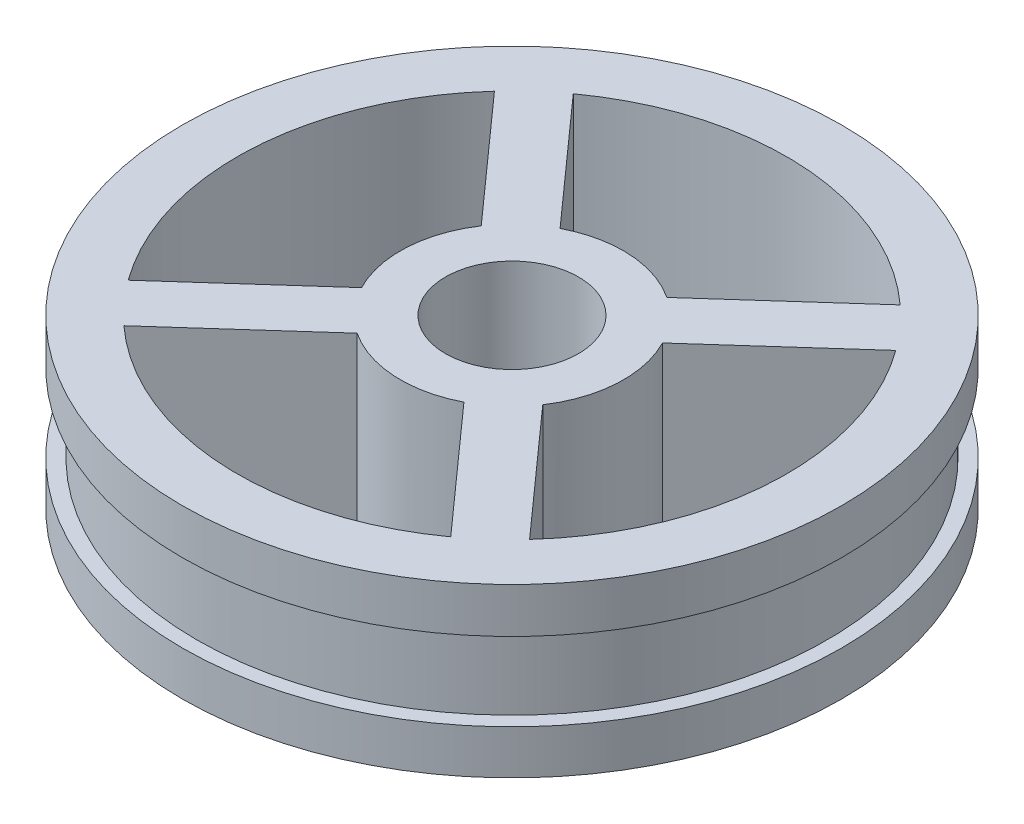
ISO-10303-21;
HEADER;
FILE_DESCRIPTION(('STEP AP214'),'2;1');
FILE_NAME('part.step','',(''),(''),'','','');
FILE_SCHEMA(('AUTOMOTIVE_DESIGN { 1 0 10303 214 1 1 1 1 }'));
ENDSEC;
DATA;
#1=APPLICATION_CONTEXT('core data for automotive mechanical design processes');
#2=APPLICATION_PROTOCOL_DEFINITION('international standard','automotive_design',2000,#1);
#3=PRODUCT_CONTEXT('',#1,'mechanical');
#4=PRODUCT('Part','Part','',(#3));
#5=PRODUCT_RELATED_PRODUCT_CATEGORY('part','',(#4));
#6=PRODUCT_DEFINITION_FORMATION('','',#4);
#7=PRODUCT_DEFINITION_CONTEXT('part definition',#1,'design');
#8=PRODUCT_DEFINITION('design','',#6,#7);
#9=PRODUCT_DEFINITION_SHAPE('','',#8);
#10=(LENGTH_UNIT() NAMED_UNIT(*) SI_UNIT(.MILLI.,.METRE.));
#11=(NAMED_UNIT(*) PLANE_ANGLE_UNIT() SI_UNIT($,.RADIAN.));
#12=(NAMED_UNIT(*) SI_UNIT($,.STERADIAN.) SOLID_ANGLE_UNIT());
#13=UNCERTAINTY_MEASURE_WITH_UNIT(LENGTH_MEASURE(1.E-05),#10,'distance_accuracy_value','');
#14=(GEOMETRIC_REPRESENTATION_CONTEXT(3) GLOBAL_UNCERTAINTY_ASSIGNED_CONTEXT((#13)) GLOBAL_UNIT_ASSIGNED_CONTEXT((#10,
#11,#12)) REPRESENTATION_CONTEXT('',''));
#15=CARTESIAN_POINT('',(0.,0.,0.));
#16=DIRECTION('',(0.,0.,1.));
#17=DIRECTION('',(1.,0.,0.));
#18=AXIS2_PLACEMENT_3D('',#15,#16,#17);
#19=CARTESIAN_POINT('',(0.,20.9873639174843,0.));
#20=DIRECTION('',(0.,-1.,0.));
#21=DIRECTION('',(0.,0.,-1.));
#22=AXIS2_PLACEMENT_3D('',#19,#20,#21);
#23=CYLINDRICAL_SURFACE('',#22,2.032);
#24=CARTESIAN_POINT('',(0.,-3.65,0.));
#25=DIRECTION('',(0.,-1.,0.));
#26=DIRECTION('',(0.,0.,-1.));
#27=AXIS2_PLACEMENT_3D('',#24,#25,#26);
#28=CIRCLE('',#27,2.032);
#29=CARTESIAN_POINT('',(0.,-3.65,-2.032));
#30=VERTEX_POINT('',#29);
#31=EDGE_CURVE('E236',#30,#30,#28,.T.);
#32=ORIENTED_EDGE('',*,*,#31,.T.);
#33=EDGE_LOOP('',(#32));
#34=FACE_BOUND('',#33,.T.);
#35=CARTESIAN_POINT('',(0.,0.,0.));
#36=DIRECTION('',(0.,1.,0.));
#37=DIRECTION('',(0.,0.,1.));
#38=AXIS2_PLACEMENT_3D('',#35,#36,#37);
#39=CIRCLE('',#38,2.032);
#40=CARTESIAN_POINT('',(0.,0.,2.032));
#41=VERTEX_POINT('',#40);
#42=EDGE_CURVE('E62',#41,#41,#39,.F.);
#43=ORIENTED_EDGE('',*,*,#42,.F.);
#44=EDGE_LOOP('',(#43));
#45=FACE_BOUND('',#44,.T.);
#46=ADVANCED_FACE('F58',(#34,#45),#23,.F.);
#47=CARTESIAN_POINT('',(0.,15.24,0.));
#48=DIRECTION('',(0.,-1.,0.));
#49=DIRECTION('',(0.,0.,-1.));
#50=AXIS2_PLACEMENT_3D('',#47,#48,#49);
#51=CYLINDRICAL_SURFACE('',#50,30.);
#52=CARTESIAN_POINT('',(0.,0.,0.));
#53=DIRECTION('',(0.,1.,0.));
#54=DIRECTION('',(0.,0.,1.));
#55=AXIS2_PLACEMENT_3D('',#52,#53,#54);
#56=CIRCLE('',#55,30.);
#57=CARTESIAN_POINT('',(0.,0.,30.));
#58=VERTEX_POINT('',#57);
#59=EDGE_CURVE('E376',#58,#58,#56,.T.);
#60=ORIENTED_EDGE('',*,*,#59,.T.);
#61=EDGE_LOOP('',(#60));
#62=FACE_BOUND('',#61,.T.);
#63=CARTESIAN_POINT('',(0.,4.02260054,0.));
#64=DIRECTION('',(0.,1.,0.));
#65=DIRECTION('',(0.,0.,1.));
#66=AXIS2_PLACEMENT_3D('',#63,#64,#65);
#67=CIRCLE('',#66,30.);
#68=CARTESIAN_POINT('',(0.,4.02260054,30.));
#69=VERTEX_POINT('',#68);
#70=EDGE_CURVE('E272',#69,#69,#67,.T.);
#71=ORIENTED_EDGE('',*,*,#70,.F.);
#72=EDGE_LOOP('',(#71));
#73=FACE_BOUND('',#72,.T.);
#74=ADVANCED_FACE('F403',(#62,#73),#51,.T.);
#75=CARTESIAN_POINT('',(0.,15.24,0.));
#76=DIRECTION('',(0.,-1.,0.));
#77=DIRECTION('',(0.,0.,-1.));
#78=AXIS2_PLACEMENT_3D('',#75,#76,#77);
#79=CYLINDRICAL_SURFACE('',#78,25.);
#80=CARTESIAN_POINT('',(0.,15.24,0.));
#81=DIRECTION('',(0.,1.,0.));
#82=DIRECTION('',(0.,0.,1.));
#83=AXIS2_PLACEMENT_3D('',#80,#81,#82);
#84=CIRCLE('',#83,25.);
#85=CARTESIAN_POINT('',(-18.4586738479268,15.24,-16.8605266755183));
#86=VERTEX_POINT('',#85);
#87=CARTESIAN_POINT('',(-20.2264090300764,15.24,14.6932766171486));
#88=VERTEX_POINT('',#87);
#89=EDGE_CURVE('E368',#86,#88,#84,.T.);
#90=ORIENTED_EDGE('',*,*,#89,.T.);
#91=DIRECTION('',(0.,1.,0.));
#92=VECTOR('',#91,1.);
#93=CARTESIAN_POINT('',(-20.2264090300764,-57.2335696705628,14.6932766171486));
#94=LINE('',#93,#92);
#95=CARTESIAN_POINT('',(-20.2264090300764,0.,14.6932766171486));
#96=VERTEX_POINT('',#95);
#97=EDGE_CURVE('E342',#96,#88,#94,.T.);
#98=ORIENTED_EDGE('',*,*,#97,.F.);
#99=CARTESIAN_POINT('',(0.,0.,0.));
#100=DIRECTION('',(0.,1.,0.));
#101=DIRECTION('',(0.,0.,1.));
#102=AXIS2_PLACEMENT_3D('',#99,#100,#101);
#103=CIRCLE('',#102,25.);
#104=CARTESIAN_POINT('',(-18.4586738479268,0.,-16.8605266755183));
#105=VERTEX_POINT('',#104);
#106=EDGE_CURVE('E373',#105,#96,#103,.T.);
#107=ORIENTED_EDGE('',*,*,#106,.F.);
#108=DIRECTION('',(0.,1.,0.));
#109=VECTOR('',#108,1.);
#110=CARTESIAN_POINT('',(-18.4586738479268,-57.2335696705628,-16.8605266755183));
#111=LINE('',#110,#109);
#112=EDGE_CURVE('E343',#105,#86,#111,.T.);
#113=ORIENTED_EDGE('',*,*,#112,.T.);
#114=EDGE_LOOP('',(#90,#98,#107,#113));
#115=FACE_BOUND('',#114,.T.);
#116=ADVANCED_FACE('F409',(#115),#79,.F.);
#117=DIRECTION('',(0.,1.,0.));
#118=VECTOR('',#117,1.);
#119=CARTESIAN_POINT('',(-16.8386084523767,-57.2335696705628,18.4786705524924));
#120=LINE('',#119,#118);
#121=CARTESIAN_POINT('',(-16.8386084523767,0.,18.4786705524924));
#122=VERTEX_POINT('',#121);
#123=CARTESIAN_POINT('',(-16.8386084523767,15.24,18.4786705524924));
#124=VERTEX_POINT('',#123);
#125=EDGE_CURVE('E360',#122,#124,#120,.T.);
#126=ORIENTED_EDGE('',*,*,#125,.T.);
#127=CARTESIAN_POINT('',(14.6692620108567,15.24,20.2438324448914));
#128=VERTEX_POINT('',#127);
#129=EDGE_CURVE('E365',#124,#128,#84,.T.);
#130=ORIENTED_EDGE('',*,*,#129,.T.);
#131=DIRECTION('',(0.,1.,0.));
#132=VECTOR('',#131,1.);
#133=CARTESIAN_POINT('',(14.6692620108567,-57.2335696705628,20.2438324448914));
#134=LINE('',#133,#132);
#135=CARTESIAN_POINT('',(14.6692620108567,0.,20.2438324448914));
#136=VERTEX_POINT('',#135);
#137=EDGE_CURVE('E358',#136,#128,#134,.T.);
#138=ORIENTED_EDGE('',*,*,#137,.F.);
#139=EDGE_CURVE('E325',#122,#136,#103,.T.);
#140=ORIENTED_EDGE('',*,*,#139,.F.);
#141=EDGE_LOOP('',(#126,#130,#138,#140));
#142=FACE_BOUND('',#141,.T.);
#143=ADVANCED_FACE('F660',(#142),#79,.F.);
#144=CARTESIAN_POINT('',(16.8386084523767,0.,-18.4786705524924));
#145=VERTEX_POINT('',#144);
#146=CARTESIAN_POINT('',(-14.6692620108567,0.,-20.2438324448914));
#147=VERTEX_POINT('',#146);
#148=EDGE_CURVE('E735',#145,#147,#103,.T.);
#149=ORIENTED_EDGE('',*,*,#148,.F.);
#150=DIRECTION('',(0.,1.,0.));
#151=VECTOR('',#150,1.);
#152=CARTESIAN_POINT('',(16.8386084523767,-57.2335696705628,-18.4786705524924));
#153=LINE('',#152,#151);
#154=CARTESIAN_POINT('',(16.8386084523767,15.24,-18.4786705524924));
#155=VERTEX_POINT('',#154);
#156=EDGE_CURVE('E349',#145,#155,#153,.T.);
#157=ORIENTED_EDGE('',*,*,#156,.T.);
#158=CARTESIAN_POINT('',(-14.6692620108567,15.24,-20.2438324448914));
#159=VERTEX_POINT('',#158);
#160=EDGE_CURVE('E697',#155,#159,#84,.T.);
#161=ORIENTED_EDGE('',*,*,#160,.T.);
#162=DIRECTION('',(0.,1.,0.));
#163=VECTOR('',#162,1.);
#164=CARTESIAN_POINT('',(-14.6692620108567,-57.2335696705628,-20.2438324448914));
#165=LINE('',#164,#163);
#166=EDGE_CURVE('E346',#147,#159,#165,.T.);
#167=ORIENTED_EDGE('',*,*,#166,.F.);
#168=EDGE_LOOP('',(#149,#157,#161,#167));
#169=FACE_BOUND('',#168,.T.);
#170=ADVANCED_FACE('F556',(#169),#79,.F.);
#171=CARTESIAN_POINT('',(0.,15.24,0.));
#172=DIRECTION('',(0.,1.,0.));
#173=DIRECTION('',(0.,0.,1.));
#174=AXIS2_PLACEMENT_3D('',#171,#172,#173);
#175=PLANE('',#174);
#176=CARTESIAN_POINT('',(0.,15.24,0.));
#177=DIRECTION('',(0.,1.,0.));
#178=DIRECTION('',(0.,0.,1.));
#179=AXIS2_PLACEMENT_3D('',#176,#177,#178);
#180=CIRCLE('',#179,6.05206443740222);
#181=CARTESIAN_POINT('',(0.,15.24,6.05206443740222));
#182=VERTEX_POINT('',#181);
#183=EDGE_CURVE('E762',#182,#182,#180,.T.);
#184=ORIENTED_EDGE('',*,*,#183,.F.);
#185=EDGE_LOOP('',(#184));
#186=FACE_BOUND('',#185,.T.);
#187=DIRECTION('',(-0.666005072711236,0.,-0.745947212021669));
#188=VECTOR('',#187,1.);
#189=CARTESIAN_POINT('',(1.89470591853503,15.24,-1.69165288468654));
#190=LINE('',#189,#188);
#191=CARTESIAN_POINT('',(18.4586738479268,15.24,16.8605266755183));
#192=VERTEX_POINT('',#191);
#193=CARTESIAN_POINT('',(8.44644936848974,15.24,5.6465115837603));
#194=VERTEX_POINT('',#193);
#195=EDGE_CURVE('E333',#192,#194,#190,.T.);
#196=ORIENTED_EDGE('',*,*,#195,.T.);
#197=CARTESIAN_POINT('',(0.,15.24,0.));
#198=DIRECTION('',(0.,-1.,0.));
#199=DIRECTION('',(0.,0.,-1.));
#200=AXIS2_PLACEMENT_3D('',#197,#198,#199);
#201=CIRCLE('',#200,10.16);
#202=CARTESIAN_POINT('',(9.02428412406039,15.24,-4.66775064117949));
#203=VERTEX_POINT('',#202);
#204=EDGE_CURVE('E281',#203,#194,#201,.T.);
#205=ORIENTED_EDGE('',*,*,#204,.F.);
#206=DIRECTION('',(0.745156286485,0.,-0.66688987749994));
#207=VECTOR('',#206,1.);
#208=CARTESIAN_POINT('',(1.69390028884985,15.24,1.8926969676719));
#209=LINE('',#208,#207);
#210=CARTESIAN_POINT('',(20.2264090300764,15.24,-14.6932766171486));
#211=VERTEX_POINT('',#210);
#212=EDGE_CURVE('E336',#203,#211,#209,.T.);
#213=ORIENTED_EDGE('',*,*,#212,.T.);
#214=EDGE_CURVE('E370',#192,#211,#84,.T.);
#215=ORIENTED_EDGE('',*,*,#214,.F.);
#216=EDGE_LOOP('',(#196,#205,#213,#215));
#217=FACE_BOUND('',#216,.T.);
#218=DIRECTION('',(0.745156286485,0.,-0.66688987749994));
#219=VECTOR('',#218,1.);
#220=CARTESIAN_POINT('',(-1.69390028884985,15.24,-1.8926969676719));
#221=LINE('',#220,#219);
#222=CARTESIAN_POINT('',(5.6364835463607,15.24,-8.45314457652329));
#223=VERTEX_POINT('',#222);
#224=EDGE_CURVE('E338',#223,#155,#221,.T.);
#225=ORIENTED_EDGE('',*,*,#224,.F.);
#226=CARTESIAN_POINT('',(-4.65703753141968,15.24,-9.02981735313337));
#227=VERTEX_POINT('',#226);
#228=EDGE_CURVE('E276',#227,#223,#201,.T.);
#229=ORIENTED_EDGE('',*,*,#228,.F.);
#230=DIRECTION('',(-0.666005072711236,0.,-0.745947212021669));
#231=VECTOR('',#230,1.);
#232=CARTESIAN_POINT('',(1.89470591853503,15.24,-1.69165288468654));
#233=LINE('',#232,#231);
#234=EDGE_CURVE('E340',#227,#159,#233,.T.);
#235=ORIENTED_EDGE('',*,*,#234,.T.);
#236=ORIENTED_EDGE('',*,*,#160,.F.);
#237=EDGE_LOOP('',(#225,#229,#235,#236));
#238=FACE_BOUND('',#237,.T.);
#239=DIRECTION('',(-0.666005072711236,0.,-0.745947212021669));
#240=VECTOR('',#239,1.);
#241=CARTESIAN_POINT('',(-1.89470591853504,15.24,1.69165288468654));
#242=LINE('',#241,#240);
#243=CARTESIAN_POINT('',(-8.44644936848975,15.24,-5.64651158376029));
#244=VERTEX_POINT('',#243);
#245=EDGE_CURVE('E305',#244,#86,#242,.T.);
#246=ORIENTED_EDGE('',*,*,#245,.F.);
#247=CARTESIAN_POINT('',(-9.02428412406039,15.24,4.6677506411795));
#248=VERTEX_POINT('',#247);
#249=EDGE_CURVE('E280',#248,#244,#201,.T.);
#250=ORIENTED_EDGE('',*,*,#249,.F.);
#251=DIRECTION('',(0.745156286485,0.,-0.66688987749994));
#252=VECTOR('',#251,1.);
#253=CARTESIAN_POINT('',(-1.69390028884985,15.24,-1.8926969676719));
#254=LINE('',#253,#252);
#255=EDGE_CURVE('E83',#88,#248,#254,.T.);
#256=ORIENTED_EDGE('',*,*,#255,.F.);
#257=ORIENTED_EDGE('',*,*,#89,.F.);
#258=EDGE_LOOP('',(#246,#250,#256,#257));
#259=FACE_BOUND('',#258,.T.);
#260=CARTESIAN_POINT('',(4.65703753141966,15.24,9.02981735313338));
#261=VERTEX_POINT('',#260);
#262=CARTESIAN_POINT('',(-5.6364835463607,15.24,8.45314457652329));
#263=VERTEX_POINT('',#262);
#264=EDGE_CURVE('E727',#261,#263,#201,.T.);
#265=ORIENTED_EDGE('',*,*,#264,.F.);
#266=DIRECTION('',(-0.666005072711236,0.,-0.745947212021669));
#267=VECTOR('',#266,1.);
#268=CARTESIAN_POINT('',(-1.89470591853504,15.24,1.69165288468654));
#269=LINE('',#268,#267);
#270=EDGE_CURVE('E331',#128,#261,#269,.T.);
#271=ORIENTED_EDGE('',*,*,#270,.F.);
#272=ORIENTED_EDGE('',*,*,#129,.F.);
#273=DIRECTION('',(0.745156286485,0.,-0.66688987749994));
#274=VECTOR('',#273,1.);
#275=CARTESIAN_POINT('',(1.69390028884985,15.24,1.8926969676719));
#276=LINE('',#275,#274);
#277=EDGE_CURVE('E328',#124,#263,#276,.T.);
#278=ORIENTED_EDGE('',*,*,#277,.T.);
#279=EDGE_LOOP('',(#265,#271,#272,#278));
#280=FACE_BOUND('',#279,.T.);
#281=CARTESIAN_POINT('',(0.,15.24,0.));
#282=DIRECTION('',(0.,1.,0.));
#283=DIRECTION('',(0.,0.,1.));
#284=AXIS2_PLACEMENT_3D('',#281,#282,#283);
#285=CIRCLE('',#284,30.);
#286=CARTESIAN_POINT('',(0.,15.24,30.));
#287=VERTEX_POINT('',#286);
#288=EDGE_CURVE('E67',#287,#287,#285,.T.);
#289=ORIENTED_EDGE('',*,*,#288,.T.);
#290=EDGE_LOOP('',(#289));
#291=FACE_BOUND('',#290,.T.);
#292=ADVANCED_FACE('F549',(#186,#217,#238,#259,#280,#291),#175,.T.);
#293=CARTESIAN_POINT('',(0.,0.,0.));
#294=DIRECTION('',(0.,1.,0.));
#295=DIRECTION('',(0.,0.,1.));
#296=AXIS2_PLACEMENT_3D('',#293,#294,#295);
#297=PLANE('',#296);
#298=DIRECTION('',(0.666005072711236,0.,0.745947212021669));
#299=VECTOR('',#298,1.);
#300=CARTESIAN_POINT('',(-1.89470591853504,0.,1.69165288468654));
#301=LINE('',#300,#299);
#302=CARTESIAN_POINT('',(4.65703753141966,0.,9.02981735313338));
#303=VERTEX_POINT('',#302);
#304=EDGE_CURVE('E308',#303,#136,#301,.T.);
#305=ORIENTED_EDGE('',*,*,#304,.F.);
#306=CARTESIAN_POINT('',(0.,0.,0.));
#307=DIRECTION('',(0.,1.,0.));
#308=DIRECTION('',(0.,0.,1.));
#309=AXIS2_PLACEMENT_3D('',#306,#307,#308);
#310=CIRCLE('',#309,10.16);
#311=CARTESIAN_POINT('',(8.44644936848974,0.,5.6465115837603));
#312=VERTEX_POINT('',#311);
#313=EDGE_CURVE('E297',#303,#312,#310,.T.);
#314=ORIENTED_EDGE('',*,*,#313,.T.);
#315=DIRECTION('',(0.666005072711236,0.,0.745947212021669));
#316=VECTOR('',#315,1.);
#317=CARTESIAN_POINT('',(1.89470591853503,0.,-1.69165288468654));
#318=LINE('',#317,#316);
#319=CARTESIAN_POINT('',(18.4586738479268,0.,16.8605266755183));
#320=VERTEX_POINT('',#319);
#321=EDGE_CURVE('E311',#312,#320,#318,.T.);
#322=ORIENTED_EDGE('',*,*,#321,.T.);
#323=CARTESIAN_POINT('',(20.2264090300764,0.,-14.6932766171486));
#324=VERTEX_POINT('',#323);
#325=EDGE_CURVE('E369',#320,#324,#103,.T.);
#326=ORIENTED_EDGE('',*,*,#325,.T.);
#327=DIRECTION('',(-0.745156286485,0.,0.66688987749994));
#328=VECTOR('',#327,1.);
#329=CARTESIAN_POINT('',(1.69390028884985,0.,1.8926969676719));
#330=LINE('',#329,#328);
#331=CARTESIAN_POINT('',(9.02428412406039,0.,-4.6677506411795));
#332=VERTEX_POINT('',#331);
#333=EDGE_CURVE('E313',#324,#332,#330,.T.);
#334=ORIENTED_EDGE('',*,*,#333,.T.);
#335=CARTESIAN_POINT('',(5.6364835463607,0.,-8.45314457652329));
#336=VERTEX_POINT('',#335);
#337=EDGE_CURVE('E286',#332,#336,#310,.T.);
#338=ORIENTED_EDGE('',*,*,#337,.T.);
#339=DIRECTION('',(-0.745156286485,0.,0.66688987749994));
#340=VECTOR('',#339,1.);
#341=CARTESIAN_POINT('',(-1.69390028884985,0.,-1.8926969676719));
#342=LINE('',#341,#340);
#343=EDGE_CURVE('E316',#145,#336,#342,.T.);
#344=ORIENTED_EDGE('',*,*,#343,.F.);
#345=ORIENTED_EDGE('',*,*,#148,.T.);
#346=DIRECTION('',(0.666005072711236,0.,0.745947212021669));
#347=VECTOR('',#346,1.);
#348=CARTESIAN_POINT('',(1.89470591853503,0.,-1.69165288468654));
#349=LINE('',#348,#347);
#350=CARTESIAN_POINT('',(-4.65703753141967,0.,-9.02981735313337));
#351=VERTEX_POINT('',#350);
#352=EDGE_CURVE('E319',#147,#351,#349,.T.);
#353=ORIENTED_EDGE('',*,*,#352,.T.);
#354=CARTESIAN_POINT('',(-8.44644936848975,0.,-5.64651158376029));
#355=VERTEX_POINT('',#354);
#356=EDGE_CURVE('E282',#351,#355,#310,.T.);
#357=ORIENTED_EDGE('',*,*,#356,.T.);
#358=DIRECTION('',(0.666005072711236,0.,0.745947212021669));
#359=VECTOR('',#358,1.);
#360=CARTESIAN_POINT('',(-1.89470591853504,0.,1.69165288468654));
#361=LINE('',#360,#359);
#362=EDGE_CURVE('E322',#105,#355,#361,.T.);
#363=ORIENTED_EDGE('',*,*,#362,.F.);
#364=ORIENTED_EDGE('',*,*,#106,.T.);
#365=DIRECTION('',(-0.745156286485,0.,0.66688987749994));
#366=VECTOR('',#365,1.);
#367=CARTESIAN_POINT('',(-1.69390028884985,0.,-1.8926969676719));
#368=LINE('',#367,#366);
#369=CARTESIAN_POINT('',(-9.02428412406039,0.,4.6677506411795));
#370=VERTEX_POINT('',#369);
#371=EDGE_CURVE('E309',#370,#96,#368,.T.);
#372=ORIENTED_EDGE('',*,*,#371,.F.);
#373=CARTESIAN_POINT('',(-5.63648354636069,0.,8.45314457652329));
#374=VERTEX_POINT('',#373);
#375=EDGE_CURVE('E285',#370,#374,#310,.T.);
#376=ORIENTED_EDGE('',*,*,#375,.T.);
#377=DIRECTION('',(-0.745156286485,0.,0.66688987749994));
#378=VECTOR('',#377,1.);
#379=CARTESIAN_POINT('',(1.69390028884985,0.,1.8926969676719));
#380=LINE('',#379,#378);
#381=EDGE_CURVE('E306',#374,#122,#380,.T.);
#382=ORIENTED_EDGE('',*,*,#381,.T.);
#383=ORIENTED_EDGE('',*,*,#139,.T.);
#384=EDGE_LOOP('',(#305,#314,#322,#326,#334,#338,#344,#345,#353,#357,#363,#364,#372,#376,#382,#383));
#385=FACE_BOUND('',#384,.T.);
#386=ORIENTED_EDGE('',*,*,#59,.F.);
#387=EDGE_LOOP('',(#386));
#388=FACE_BOUND('',#387,.T.);
#389=ADVANCED_FACE('F555',(#385,#388),#297,.F.);
#390=CARTESIAN_POINT('',(0.,11.14119946,0.));
#391=DIRECTION('',(0.,1.,0.));
#392=DIRECTION('',(0.,0.,1.));
#393=AXIS2_PLACEMENT_3D('',#390,#391,#392);
#394=CIRCLE('',#393,30.);
#395=CARTESIAN_POINT('',(0.,11.14119946,30.));
#396=VERTEX_POINT('',#395);
#397=EDGE_CURVE('E277',#396,#396,#394,.T.);
#398=ORIENTED_EDGE('',*,*,#397,.T.);
#399=EDGE_LOOP('',(#398));
#400=FACE_BOUND('',#399,.T.);
#401=ORIENTED_EDGE('',*,*,#288,.F.);
#402=EDGE_LOOP('',(#401));
#403=FACE_BOUND('',#402,.T.);
#404=ADVANCED_FACE('F60',(#400,#403),#51,.T.);
#405=DIRECTION('',(0.,1.,0.));
#406=VECTOR('',#405,1.);
#407=CARTESIAN_POINT('',(18.4586738479268,-57.2335696705628,16.8605266755183));
#408=LINE('',#407,#406);
#409=EDGE_CURVE('E355',#320,#192,#408,.T.);
#410=ORIENTED_EDGE('',*,*,#409,.T.);
#411=ORIENTED_EDGE('',*,*,#214,.T.);
#412=DIRECTION('',(0.,1.,0.));
#413=VECTOR('',#412,1.);
#414=CARTESIAN_POINT('',(20.2264090300764,-57.2335696705628,-14.6932766171486));
#415=LINE('',#414,#413);
#416=EDGE_CURVE('E352',#324,#211,#415,.T.);
#417=ORIENTED_EDGE('',*,*,#416,.F.);
#418=ORIENTED_EDGE('',*,*,#325,.F.);
#419=EDGE_LOOP('',(#410,#411,#417,#418));
#420=FACE_BOUND('',#419,.T.);
#421=ADVANCED_FACE('F630',(#420),#79,.F.);
#422=CARTESIAN_POINT('',(-1.69390028884985,-57.2335696705628,-1.8926969676719));
#423=DIRECTION('',(0.66688987749994,0.,0.745156286485));
#424=DIRECTION('',(0.745156286485,0.,-0.66688987749994));
#425=AXIS2_PLACEMENT_3D('',#422,#423,#424);
#426=PLANE('',#425);
#427=ORIENTED_EDGE('',*,*,#255,.T.);
#428=DIRECTION('',(0.,-1.,0.));
#429=VECTOR('',#428,1.);
#430=CARTESIAN_POINT('',(-9.02428412406039,15.24,4.6677506411795));
#431=LINE('',#430,#429);
#432=EDGE_CURVE('E303',#248,#370,#431,.T.);
#433=ORIENTED_EDGE('',*,*,#432,.T.);
#434=ORIENTED_EDGE('',*,*,#371,.T.);
#435=ORIENTED_EDGE('',*,*,#97,.T.);
#436=EDGE_LOOP('',(#427,#433,#434,#435));
#437=FACE_BOUND('',#436,.T.);
#438=ADVANCED_FACE('F622',(#437),#426,.F.);
#439=CARTESIAN_POINT('',(1.69390028884985,-57.2335696705628,1.8926969676719));
#440=DIRECTION('',(0.66688987749994,0.,0.745156286485));
#441=DIRECTION('',(0.745156286485,0.,-0.66688987749994));
#442=AXIS2_PLACEMENT_3D('',#439,#440,#441);
#443=PLANE('',#442);
#444=DIRECTION('',(0.,-1.,0.));
#445=VECTOR('',#444,1.);
#446=CARTESIAN_POINT('',(-5.63648354636069,15.24,8.45314457652329));
#447=LINE('',#446,#445);
#448=EDGE_CURVE('E300',#263,#374,#447,.T.);
#449=ORIENTED_EDGE('',*,*,#448,.F.);
#450=ORIENTED_EDGE('',*,*,#277,.F.);
#451=ORIENTED_EDGE('',*,*,#125,.F.);
#452=ORIENTED_EDGE('',*,*,#381,.F.);
#453=EDGE_LOOP('',(#449,#450,#451,#452));
#454=FACE_BOUND('',#453,.T.);
#455=ADVANCED_FACE('F613',(#454),#443,.T.);
#456=CARTESIAN_POINT('',(-1.89470591853504,-57.2335696705628,1.69165288468654));
#457=DIRECTION('',(0.745947212021669,0.,-0.666005072711236));
#458=DIRECTION('',(-0.666005072711236,0.,-0.745947212021669));
#459=AXIS2_PLACEMENT_3D('',#456,#457,#458);
#460=PLANE('',#459);
#461=ORIENTED_EDGE('',*,*,#270,.T.);
#462=DIRECTION('',(0.,-1.,0.));
#463=VECTOR('',#462,1.);
#464=CARTESIAN_POINT('',(4.65703753141966,15.24,9.02981735313338));
#465=LINE('',#464,#463);
#466=EDGE_CURVE('E298',#261,#303,#465,.T.);
#467=ORIENTED_EDGE('',*,*,#466,.T.);
#468=ORIENTED_EDGE('',*,*,#304,.T.);
#469=ORIENTED_EDGE('',*,*,#137,.T.);
#470=EDGE_LOOP('',(#461,#467,#468,#469));
#471=FACE_BOUND('',#470,.T.);
#472=ADVANCED_FACE('F604',(#471),#460,.F.);
#473=CARTESIAN_POINT('',(1.89470591853503,-57.2335696705628,-1.69165288468654));
#474=DIRECTION('',(0.745947212021669,0.,-0.666005072711236));
#475=DIRECTION('',(-0.666005072711236,0.,-0.745947212021669));
#476=AXIS2_PLACEMENT_3D('',#473,#474,#475);
#477=PLANE('',#476);
#478=DIRECTION('',(0.,-1.,0.));
#479=VECTOR('',#478,1.);
#480=CARTESIAN_POINT('',(8.44644936848974,15.24,5.6465115837603));
#481=LINE('',#480,#479);
#482=EDGE_CURVE('E294',#194,#312,#481,.T.);
#483=ORIENTED_EDGE('',*,*,#482,.F.);
#484=ORIENTED_EDGE('',*,*,#195,.F.);
#485=ORIENTED_EDGE('',*,*,#409,.F.);
#486=ORIENTED_EDGE('',*,*,#321,.F.);
#487=EDGE_LOOP('',(#483,#484,#485,#486));
#488=FACE_BOUND('',#487,.T.);
#489=ADVANCED_FACE('F595',(#488),#477,.T.);
#490=CARTESIAN_POINT('',(1.69390028884985,-57.2335696705628,1.8926969676719));
#491=DIRECTION('',(0.66688987749994,0.,0.745156286485));
#492=DIRECTION('',(0.745156286485,0.,-0.66688987749994));
#493=AXIS2_PLACEMENT_3D('',#490,#491,#492);
#494=PLANE('',#493);
#495=DIRECTION('',(0.,-1.,0.));
#496=VECTOR('',#495,1.);
#497=CARTESIAN_POINT('',(9.02428412406039,15.24,-4.66775064117949));
#498=LINE('',#497,#496);
#499=EDGE_CURVE('E291',#332,#203,#498,.F.);
#500=ORIENTED_EDGE('',*,*,#499,.F.);
#501=ORIENTED_EDGE('',*,*,#333,.F.);
#502=ORIENTED_EDGE('',*,*,#416,.T.);
#503=ORIENTED_EDGE('',*,*,#212,.F.);
#504=EDGE_LOOP('',(#500,#501,#502,#503));
#505=FACE_BOUND('',#504,.T.);
#506=ADVANCED_FACE('F586',(#505),#494,.T.);
#507=CARTESIAN_POINT('',(-1.69390028884985,-57.2335696705628,-1.8926969676719));
#508=DIRECTION('',(0.66688987749994,0.,0.745156286485));
#509=DIRECTION('',(0.745156286485,0.,-0.66688987749994));
#510=AXIS2_PLACEMENT_3D('',#507,#508,#509);
#511=PLANE('',#510);
#512=ORIENTED_EDGE('',*,*,#343,.T.);
#513=DIRECTION('',(0.,-1.,0.));
#514=VECTOR('',#513,1.);
#515=CARTESIAN_POINT('',(5.6364835463607,15.24,-8.45314457652329));
#516=LINE('',#515,#514);
#517=EDGE_CURVE('E289',#336,#223,#516,.F.);
#518=ORIENTED_EDGE('',*,*,#517,.T.);
#519=ORIENTED_EDGE('',*,*,#224,.T.);
#520=ORIENTED_EDGE('',*,*,#156,.F.);
#521=EDGE_LOOP('',(#512,#518,#519,#520));
#522=FACE_BOUND('',#521,.T.);
#523=ADVANCED_FACE('F577',(#522),#511,.F.);
#524=CARTESIAN_POINT('',(1.89470591853503,-57.2335696705628,-1.69165288468654));
#525=DIRECTION('',(0.745947212021669,0.,-0.666005072711236));
#526=DIRECTION('',(-0.666005072711236,0.,-0.745947212021669));
#527=AXIS2_PLACEMENT_3D('',#524,#525,#526);
#528=PLANE('',#527);
#529=DIRECTION('',(0.,-1.,0.));
#530=VECTOR('',#529,1.);
#531=CARTESIAN_POINT('',(-4.65703753141967,15.24,-9.02981735313337));
#532=LINE('',#531,#530);
#533=EDGE_CURVE('E284',#351,#227,#532,.F.);
#534=ORIENTED_EDGE('',*,*,#533,.F.);
#535=ORIENTED_EDGE('',*,*,#352,.F.);
#536=ORIENTED_EDGE('',*,*,#166,.T.);
#537=ORIENTED_EDGE('',*,*,#234,.F.);
#538=EDGE_LOOP('',(#534,#535,#536,#537));
#539=FACE_BOUND('',#538,.T.);
#540=ADVANCED_FACE('F568',(#539),#528,.T.);
#541=CARTESIAN_POINT('',(-1.89470591853504,-57.2335696705628,1.69165288468654));
#542=DIRECTION('',(0.745947212021669,0.,-0.666005072711236));
#543=DIRECTION('',(-0.666005072711236,0.,-0.745947212021669));
#544=AXIS2_PLACEMENT_3D('',#541,#542,#543);
#545=PLANE('',#544);
#546=ORIENTED_EDGE('',*,*,#362,.T.);
#547=DIRECTION('',(0.,-1.,0.));
#548=VECTOR('',#547,1.);
#549=CARTESIAN_POINT('',(-8.44644936848974,15.24,-5.64651158376029));
#550=LINE('',#549,#548);
#551=EDGE_CURVE('E14',#355,#244,#550,.F.);
#552=ORIENTED_EDGE('',*,*,#551,.T.);
#553=ORIENTED_EDGE('',*,*,#245,.T.);
#554=ORIENTED_EDGE('',*,*,#112,.F.);
#555=EDGE_LOOP('',(#546,#552,#553,#554));
#556=FACE_BOUND('',#555,.T.);
#557=ADVANCED_FACE('F544',(#556),#545,.F.);
#558=CARTESIAN_POINT('',(0.,15.24,0.));
#559=DIRECTION('',(0.,-1.,0.));
#560=DIRECTION('',(0.,0.,-1.));
#561=AXIS2_PLACEMENT_3D('',#558,#559,#560);
#562=CYLINDRICAL_SURFACE('',#561,10.16);
#563=CARTESIAN_POINT('',(0.,-10.,0.));
#564=DIRECTION('',(0.,-1.,0.));
#565=DIRECTION('',(0.,0.,-1.));
#566=AXIS2_PLACEMENT_3D('',#563,#564,#565);
#567=CIRCLE('',#566,10.16);
#568=CARTESIAN_POINT('',(0.,-10.,-10.16));
#569=VERTEX_POINT('',#568);
#570=EDGE_CURVE('E273',#569,#569,#567,.T.);
#571=ORIENTED_EDGE('',*,*,#570,.F.);
#572=EDGE_LOOP('',(#571));
#573=FACE_BOUND('',#572,.T.);
#574=ORIENTED_EDGE('',*,*,#432,.F.);
#575=ORIENTED_EDGE('',*,*,#249,.T.);
#576=ORIENTED_EDGE('',*,*,#551,.F.);
#577=ORIENTED_EDGE('',*,*,#356,.F.);
#578=ORIENTED_EDGE('',*,*,#533,.T.);
#579=ORIENTED_EDGE('',*,*,#228,.T.);
#580=ORIENTED_EDGE('',*,*,#517,.F.);
#581=ORIENTED_EDGE('',*,*,#337,.F.);
#582=ORIENTED_EDGE('',*,*,#499,.T.);
#583=ORIENTED_EDGE('',*,*,#204,.T.);
#584=ORIENTED_EDGE('',*,*,#482,.T.);
#585=ORIENTED_EDGE('',*,*,#313,.F.);
#586=ORIENTED_EDGE('',*,*,#466,.F.);
#587=ORIENTED_EDGE('',*,*,#264,.T.);
#588=ORIENTED_EDGE('',*,*,#448,.T.);
#589=ORIENTED_EDGE('',*,*,#375,.F.);
#590=EDGE_LOOP('',(#574,#575,#576,#577,#578,#579,#580,#581,#582,#583,#584,#585,#586,#587,#588,#589));
#591=FACE_BOUND('',#590,.T.);
#592=ADVANCED_FACE('F398',(#573,#591),#562,.T.);
#593=CARTESIAN_POINT('',(0.,-10.,0.));
#594=DIRECTION('',(0.,-1.,0.));
#595=DIRECTION('',(0.,0.,-1.));
#596=AXIS2_PLACEMENT_3D('',#593,#594,#595);
#597=PLANE('',#596);
#598=DIRECTION('',(0.5,0.,0.866025403784439));
#599=VECTOR('',#598,1.);
#600=CARTESIAN_POINT('',(3.59285072516704,-10.,-6.223));
#601=LINE('',#600,#599);
#602=CARTESIAN_POINT('',(3.59285072516704,-10.,-6.223));
#603=VERTEX_POINT('',#602);
#604=CARTESIAN_POINT('',(7.18570145033409,-10.,0.));
#605=VERTEX_POINT('',#604);
#606=EDGE_CURVE('E75',#603,#605,#601,.T.);
#607=ORIENTED_EDGE('',*,*,#606,.F.);
#608=DIRECTION('',(1.,0.,0.));
#609=VECTOR('',#608,1.);
#610=CARTESIAN_POINT('',(-3.59285072516704,-10.,-6.223));
#611=LINE('',#610,#609);
#612=CARTESIAN_POINT('',(-3.59285072516704,-10.,-6.223));
#613=VERTEX_POINT('',#612);
#614=EDGE_CURVE('E230',#613,#603,#611,.T.);
#615=ORIENTED_EDGE('',*,*,#614,.F.);
#616=DIRECTION('',(0.5,0.,-0.866025403784438));
#617=VECTOR('',#616,1.);
#618=CARTESIAN_POINT('',(-7.18570145033408,-10.,0.));
#619=LINE('',#618,#617);
#620=CARTESIAN_POINT('',(-7.18570145033408,-10.,0.));
#621=VERTEX_POINT('',#620);
#622=EDGE_CURVE('E233',#621,#613,#619,.T.);
#623=ORIENTED_EDGE('',*,*,#622,.F.);
#624=DIRECTION('',(-0.5,0.,-0.866025403784439));
#625=VECTOR('',#624,1.);
#626=CARTESIAN_POINT('',(-3.59285072516704,-10.,6.223));
#627=LINE('',#626,#625);
#628=CARTESIAN_POINT('',(-3.59285072516704,-10.,6.223));
#629=VERTEX_POINT('',#628);
#630=EDGE_CURVE('E252',#629,#621,#627,.T.);
#631=ORIENTED_EDGE('',*,*,#630,.F.);
#632=DIRECTION('',(-1.,0.,0.));
#633=VECTOR('',#632,1.);
#634=CARTESIAN_POINT('',(3.59285072516704,-10.,6.223));
#635=LINE('',#634,#633);
#636=CARTESIAN_POINT('',(3.59285072516704,-10.,6.223));
#637=VERTEX_POINT('',#636);
#638=EDGE_CURVE('E249',#637,#629,#635,.T.);
#639=ORIENTED_EDGE('',*,*,#638,.F.);
#640=DIRECTION('',(-0.5,0.,0.866025403784438));
#641=VECTOR('',#640,1.);
#642=CARTESIAN_POINT('',(7.18570145033408,-10.,0.));
#643=LINE('',#642,#641);
#644=EDGE_CURVE('E247',#605,#637,#643,.T.);
#645=ORIENTED_EDGE('',*,*,#644,.F.);
#646=EDGE_LOOP('',(#607,#615,#623,#631,#639,#645));
#647=FACE_BOUND('',#646,.T.);
#648=ORIENTED_EDGE('',*,*,#570,.T.);
#649=EDGE_LOOP('',(#648));
#650=FACE_BOUND('',#649,.T.);
#651=ADVANCED_FACE('F388',(#647,#650),#597,.T.);
#652=CARTESIAN_POINT('',(0.,11.14119946,0.));
#653=DIRECTION('',(0.,1.,0.));
#654=DIRECTION('',(0.,0.,1.));
#655=AXIS2_PLACEMENT_3D('',#652,#653,#654);
#656=PLANE('',#655);
#657=CARTESIAN_POINT('',(0.,11.14119946,0.));
#658=DIRECTION('',(0.,1.,0.));
#659=DIRECTION('',(0.,0.,1.));
#660=AXIS2_PLACEMENT_3D('',#657,#658,#659);
#661=CIRCLE('',#660,28.702);
#662=CARTESIAN_POINT('',(0.,11.14119946,28.702));
#663=VERTEX_POINT('',#662);
#664=EDGE_CURVE('E269',#663,#663,#661,.T.);
#665=ORIENTED_EDGE('',*,*,#664,.T.);
#666=EDGE_LOOP('',(#665));
#667=FACE_BOUND('',#666,.T.);
#668=ORIENTED_EDGE('',*,*,#397,.F.);
#669=EDGE_LOOP('',(#668));
#670=FACE_BOUND('',#669,.T.);
#671=ADVANCED_FACE('F385',(#667,#670),#656,.F.);
#672=CARTESIAN_POINT('',(0.,4.02260054,0.));
#673=DIRECTION('',(0.,1.,0.));
#674=DIRECTION('',(0.,0.,1.));
#675=AXIS2_PLACEMENT_3D('',#672,#673,#674);
#676=PLANE('',#675);
#677=CARTESIAN_POINT('',(0.,4.02260054,0.));
#678=DIRECTION('',(0.,1.,0.));
#679=DIRECTION('',(0.,0.,1.));
#680=AXIS2_PLACEMENT_3D('',#677,#678,#679);
#681=CIRCLE('',#680,28.702);
#682=CARTESIAN_POINT('',(0.,4.02260054,28.702));
#683=VERTEX_POINT('',#682);
#684=EDGE_CURVE('E259',#683,#683,#681,.T.);
#685=ORIENTED_EDGE('',*,*,#684,.F.);
#686=EDGE_LOOP('',(#685));
#687=FACE_BOUND('',#686,.T.);
#688=ORIENTED_EDGE('',*,*,#70,.T.);
#689=EDGE_LOOP('',(#688));
#690=FACE_BOUND('',#689,.T.);
#691=ADVANCED_FACE('F387',(#687,#690),#676,.T.);
#692=CARTESIAN_POINT('',(0.,11.14119946,0.));
#693=DIRECTION('',(0.,-1.,0.));
#694=DIRECTION('',(0.,0.,-1.));
#695=AXIS2_PLACEMENT_3D('',#692,#693,#694);
#696=CYLINDRICAL_SURFACE('',#695,28.702);
#697=ORIENTED_EDGE('',*,*,#664,.F.);
#698=EDGE_LOOP('',(#697));
#699=FACE_BOUND('',#698,.T.);
#700=ORIENTED_EDGE('',*,*,#684,.T.);
#701=EDGE_LOOP('',(#700));
#702=FACE_BOUND('',#701,.T.);
#703=ADVANCED_FACE('F395',(#699,#702),#696,.T.);
#704=CARTESIAN_POINT('',(3.59285072516704,-3.65,-6.223));
#705=DIRECTION('',(0.866025403784439,0.,-0.5));
#706=DIRECTION('',(-0.5,0.,-0.866025403784439));
#707=AXIS2_PLACEMENT_3D('',#704,#705,#706);
#708=PLANE('',#707);
#709=ORIENTED_EDGE('',*,*,#606,.T.);
#710=DIRECTION('',(0.,-1.,0.));
#711=VECTOR('',#710,1.);
#712=CARTESIAN_POINT('',(7.18570145033408,-3.65,0.));
#713=LINE('',#712,#711);
#714=CARTESIAN_POINT('',(7.18570145033408,-3.65,0.));
#715=VERTEX_POINT('',#714);
#716=EDGE_CURVE('E207',#715,#605,#713,.T.);
#717=ORIENTED_EDGE('',*,*,#716,.F.);
#718=DIRECTION('',(0.5,0.,0.866025403784439));
#719=VECTOR('',#718,1.);
#720=CARTESIAN_POINT('',(3.59285072516704,-3.65,-6.223));
#721=LINE('',#720,#719);
#722=CARTESIAN_POINT('',(3.59285072516704,-3.65,-6.223));
#723=VERTEX_POINT('',#722);
#724=EDGE_CURVE('E211',#723,#715,#721,.T.);
#725=ORIENTED_EDGE('',*,*,#724,.F.);
#726=DIRECTION('',(0.,-1.,0.));
#727=VECTOR('',#726,1.);
#728=CARTESIAN_POINT('',(3.59285072516704,-3.65,-6.223));
#729=LINE('',#728,#727);
#730=EDGE_CURVE('E257',#723,#603,#729,.T.);
#731=ORIENTED_EDGE('',*,*,#730,.T.);
#732=EDGE_LOOP('',(#709,#717,#725,#731));
#733=FACE_BOUND('',#732,.T.);
#734=ADVANCED_FACE('F209',(#733),#708,.F.);
#735=CARTESIAN_POINT('',(-3.59285072516704,-3.65,-6.223));
#736=DIRECTION('',(0.,0.,-1.));
#737=DIRECTION('',(-1.,0.,0.));
#738=AXIS2_PLACEMENT_3D('',#735,#736,#737);
#739=PLANE('',#738);
#740=ORIENTED_EDGE('',*,*,#614,.T.);
#741=ORIENTED_EDGE('',*,*,#730,.F.);
#742=DIRECTION('',(1.,0.,0.));
#743=VECTOR('',#742,1.);
#744=CARTESIAN_POINT('',(-3.59285072516704,-3.65,-6.223));
#745=LINE('',#744,#743);
#746=CARTESIAN_POINT('',(-3.59285072516704,-3.65,-6.223));
#747=VERTEX_POINT('',#746);
#748=EDGE_CURVE('E217',#747,#723,#745,.T.);
#749=ORIENTED_EDGE('',*,*,#748,.F.);
#750=DIRECTION('',(0.,-1.,0.));
#751=VECTOR('',#750,1.);
#752=CARTESIAN_POINT('',(-3.59285072516704,-3.65,-6.223));
#753=LINE('',#752,#751);
#754=EDGE_CURVE('E260',#747,#613,#753,.T.);
#755=ORIENTED_EDGE('',*,*,#754,.T.);
#756=EDGE_LOOP('',(#740,#741,#749,#755));
#757=FACE_BOUND('',#756,.T.);
#758=ADVANCED_FACE('F421',(#757),#739,.F.);
#759=CARTESIAN_POINT('',(-7.18570145033408,-3.65,0.));
#760=DIRECTION('',(-0.866025403784438,0.,-0.5));
#761=DIRECTION('',(-0.5,0.,0.866025403784439));
#762=AXIS2_PLACEMENT_3D('',#759,#760,#761);
#763=PLANE('',#762);
#764=ORIENTED_EDGE('',*,*,#622,.T.);
#765=ORIENTED_EDGE('',*,*,#754,.F.);
#766=DIRECTION('',(0.5,0.,-0.866025403784438));
#767=VECTOR('',#766,1.);
#768=CARTESIAN_POINT('',(-7.18570145033408,-3.65,0.));
#769=LINE('',#768,#767);
#770=CARTESIAN_POINT('',(-7.18570145033408,-3.65,0.));
#771=VERTEX_POINT('',#770);
#772=EDGE_CURVE('E243',#771,#747,#769,.T.);
#773=ORIENTED_EDGE('',*,*,#772,.F.);
#774=DIRECTION('',(0.,-1.,0.));
#775=VECTOR('',#774,1.);
#776=CARTESIAN_POINT('',(-7.18570145033408,-3.65,0.));
#777=LINE('',#776,#775);
#778=EDGE_CURVE('E262',#771,#621,#777,.T.);
#779=ORIENTED_EDGE('',*,*,#778,.T.);
#780=EDGE_LOOP('',(#764,#765,#773,#779));
#781=FACE_BOUND('',#780,.T.);
#782=ADVANCED_FACE('F424',(#781),#763,.F.);
#783=CARTESIAN_POINT('',(-3.59285072516704,-3.65,6.223));
#784=DIRECTION('',(-0.866025403784439,0.,0.5));
#785=DIRECTION('',(0.5,0.,0.866025403784439));
#786=AXIS2_PLACEMENT_3D('',#783,#784,#785);
#787=PLANE('',#786);
#788=ORIENTED_EDGE('',*,*,#630,.T.);
#789=ORIENTED_EDGE('',*,*,#778,.F.);
#790=DIRECTION('',(-0.5,0.,-0.866025403784439));
#791=VECTOR('',#790,1.);
#792=CARTESIAN_POINT('',(-3.59285072516704,-3.65,6.223));
#793=LINE('',#792,#791);
#794=CARTESIAN_POINT('',(-3.59285072516704,-3.65,6.223));
#795=VERTEX_POINT('',#794);
#796=EDGE_CURVE('E240',#795,#771,#793,.T.);
#797=ORIENTED_EDGE('',*,*,#796,.F.);
#798=DIRECTION('',(0.,-1.,0.));
#799=VECTOR('',#798,1.);
#800=CARTESIAN_POINT('',(-3.59285072516704,-3.65,6.223));
#801=LINE('',#800,#799);
#802=EDGE_CURVE('E264',#795,#629,#801,.T.);
#803=ORIENTED_EDGE('',*,*,#802,.T.);
#804=EDGE_LOOP('',(#788,#789,#797,#803));
#805=FACE_BOUND('',#804,.T.);
#806=ADVANCED_FACE('F428',(#805),#787,.F.);
#807=CARTESIAN_POINT('',(3.59285072516704,-3.65,6.223));
#808=DIRECTION('',(0.,0.,1.));
#809=DIRECTION('',(1.,0.,0.));
#810=AXIS2_PLACEMENT_3D('',#807,#808,#809);
#811=PLANE('',#810);
#812=ORIENTED_EDGE('',*,*,#638,.T.);
#813=ORIENTED_EDGE('',*,*,#802,.F.);
#814=DIRECTION('',(-1.,0.,0.));
#815=VECTOR('',#814,1.);
#816=CARTESIAN_POINT('',(3.59285072516704,-3.65,6.223));
#817=LINE('',#816,#815);
#818=CARTESIAN_POINT('',(3.59285072516704,-3.65,6.223));
#819=VERTEX_POINT('',#818);
#820=EDGE_CURVE('E225',#819,#795,#817,.T.);
#821=ORIENTED_EDGE('',*,*,#820,.F.);
#822=DIRECTION('',(0.,-1.,0.));
#823=VECTOR('',#822,1.);
#824=CARTESIAN_POINT('',(3.59285072516704,-3.65,6.223));
#825=LINE('',#824,#823);
#826=EDGE_CURVE('E216',#819,#637,#825,.T.);
#827=ORIENTED_EDGE('',*,*,#826,.T.);
#828=EDGE_LOOP('',(#812,#813,#821,#827));
#829=FACE_BOUND('',#828,.T.);
#830=ADVANCED_FACE('F432',(#829),#811,.F.);
#831=CARTESIAN_POINT('',(7.18570145033408,-3.65,0.));
#832=DIRECTION('',(0.866025403784438,0.,0.5));
#833=DIRECTION('',(0.5,0.,-0.866025403784438));
#834=AXIS2_PLACEMENT_3D('',#831,#832,#833);
#835=PLANE('',#834);
#836=ORIENTED_EDGE('',*,*,#644,.T.);
#837=ORIENTED_EDGE('',*,*,#826,.F.);
#838=DIRECTION('',(-0.5,0.,0.866025403784438));
#839=VECTOR('',#838,1.);
#840=CARTESIAN_POINT('',(7.18570145033408,-3.65,0.));
#841=LINE('',#840,#839);
#842=EDGE_CURVE('E220',#715,#819,#841,.T.);
#843=ORIENTED_EDGE('',*,*,#842,.F.);
#844=ORIENTED_EDGE('',*,*,#716,.T.);
#845=EDGE_LOOP('',(#836,#837,#843,#844));
#846=FACE_BOUND('',#845,.T.);
#847=ADVANCED_FACE('F221',(#846),#835,.F.);
#848=CARTESIAN_POINT('',(0.,-3.65,0.));
#849=DIRECTION('',(0.,-1.,0.));
#850=DIRECTION('',(0.,0.,-1.));
#851=AXIS2_PLACEMENT_3D('',#848,#849,#850);
#852=PLANE('',#851);
#853=ORIENTED_EDGE('',*,*,#31,.F.);
#854=EDGE_LOOP('',(#853));
#855=FACE_BOUND('',#854,.T.);
#856=ORIENTED_EDGE('',*,*,#724,.T.);
#857=ORIENTED_EDGE('',*,*,#842,.T.);
#858=ORIENTED_EDGE('',*,*,#820,.T.);
#859=ORIENTED_EDGE('',*,*,#796,.T.);
#860=ORIENTED_EDGE('',*,*,#772,.T.);
#861=ORIENTED_EDGE('',*,*,#748,.T.);
#862=EDGE_LOOP('',(#856,#857,#858,#859,#860,#861));
#863=FACE_BOUND('',#862,.T.);
#864=ADVANCED_FACE('F227',(#855,#863),#852,.T.);
#865=CARTESIAN_POINT('',(0.,0.,0.));
#866=DIRECTION('',(0.,1.,0.));
#867=DIRECTION('',(0.,0.,1.));
#868=AXIS2_PLACEMENT_3D('',#865,#866,#867);
#869=PLANE('',#868);
#870=CARTESIAN_POINT('',(0.,0.,0.));
#871=DIRECTION('',(0.,1.,0.));
#872=DIRECTION('',(0.,0.,1.));
#873=AXIS2_PLACEMENT_3D('',#870,#871,#872);
#874=CIRCLE('',#873,6.05206443740222);
#875=CARTESIAN_POINT('',(0.,0.,6.05206443740222));
#876=VERTEX_POINT('',#875);
#877=EDGE_CURVE('E764',#876,#876,#874,.T.);
#878=ORIENTED_EDGE('',*,*,#877,.T.);
#879=EDGE_LOOP('',(#878));
#880=FACE_BOUND('',#879,.T.);
#881=ORIENTED_EDGE('',*,*,#42,.T.);
#882=EDGE_LOOP('',(#881));
#883=FACE_BOUND('',#882,.T.);
#884=ADVANCED_FACE('F419',(#880,#883),#869,.T.);
#885=CARTESIAN_POINT('',(0.,0.,0.));
#886=DIRECTION('',(0.,1.,0.));
#887=DIRECTION('',(0.,0.,1.));
#888=AXIS2_PLACEMENT_3D('',#885,#886,#887);
#889=CYLINDRICAL_SURFACE('',#888,6.05206443740222);
#890=ORIENTED_EDGE('',*,*,#877,.F.);
#891=EDGE_LOOP('',(#890));
#892=FACE_BOUND('',#891,.T.);
#893=ORIENTED_EDGE('',*,*,#183,.T.);
#894=EDGE_LOOP('',(#893));
#895=FACE_BOUND('',#894,.T.);
#896=ADVANCED_FACE('F415',(#892,#895),#889,.F.);
#897=CLOSED_SHELL('',(#46,#74,#116,#143,#170,#292,#389,#404,#421,#438,#455,#472,#489,#506,#523,
#540,#557,#592,#651,#671,#691,#703,#734,#758,#782,#806,#830,#847,#864,#884,#896));
#898=MANIFOLD_SOLID_BREP('B2',#897);
#899=ADVANCED_BREP_SHAPE_REPRESENTATION('',(#18,#898),#14);
#900=SHAPE_DEFINITION_REPRESENTATION(#9,#899);
ENDSEC;
END-ISO-10303-21;
